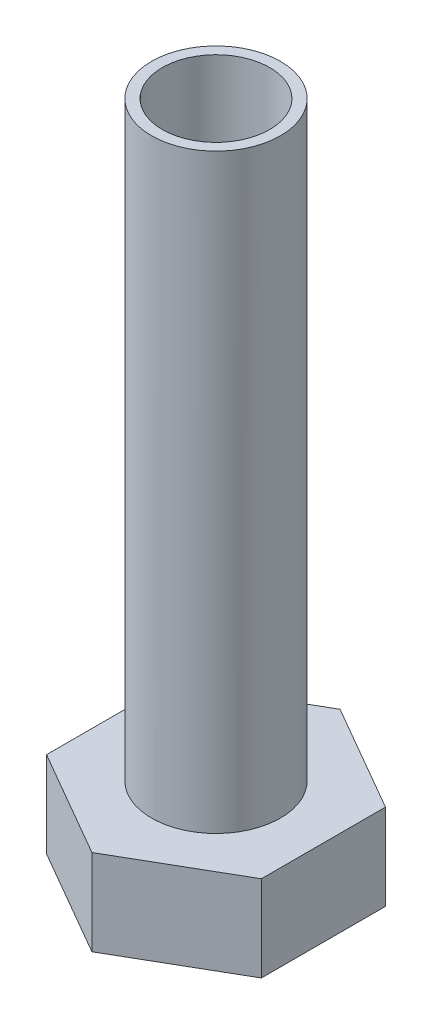
ISO-10303-21;
HEADER;
FILE_DESCRIPTION(('STEP AP214'),'2;1');
FILE_NAME('part.step','',(''),(''),'','','');
FILE_SCHEMA(('AUTOMOTIVE_DESIGN { 1 0 10303 214 1 1 1 1 }'));
ENDSEC;
DATA;
#1=APPLICATION_CONTEXT('core data for automotive mechanical design processes');
#2=APPLICATION_PROTOCOL_DEFINITION('international standard','automotive_design',2000,#1);
#3=PRODUCT_CONTEXT('',#1,'mechanical');
#4=PRODUCT('Part','Part','',(#3));
#5=PRODUCT_RELATED_PRODUCT_CATEGORY('part','',(#4));
#6=PRODUCT_DEFINITION_FORMATION('','',#4);
#7=PRODUCT_DEFINITION_CONTEXT('part definition',#1,'design');
#8=PRODUCT_DEFINITION('design','',#6,#7);
#9=PRODUCT_DEFINITION_SHAPE('','',#8);
#10=(LENGTH_UNIT() NAMED_UNIT(*) SI_UNIT(.MILLI.,.METRE.));
#11=(NAMED_UNIT(*) PLANE_ANGLE_UNIT() SI_UNIT($,.RADIAN.));
#12=(NAMED_UNIT(*) SI_UNIT($,.STERADIAN.) SOLID_ANGLE_UNIT());
#13=UNCERTAINTY_MEASURE_WITH_UNIT(LENGTH_MEASURE(1.E-05),#10,'distance_accuracy_value','');
#14=(GEOMETRIC_REPRESENTATION_CONTEXT(3) GLOBAL_UNCERTAINTY_ASSIGNED_CONTEXT((#13)) GLOBAL_UNIT_ASSIGNED_CONTEXT((#10,
#11,#12)) REPRESENTATION_CONTEXT('',''));
#15=CARTESIAN_POINT('',(0.,0.,0.));
#16=DIRECTION('',(0.,0.,1.));
#17=DIRECTION('',(1.,0.,0.));
#18=AXIS2_PLACEMENT_3D('',#15,#16,#17);
#19=CARTESIAN_POINT('',(0.,27.5,0.));
#20=DIRECTION('',(0.,1.,0.));
#21=DIRECTION('',(0.,0.,1.));
#22=AXIS2_PLACEMENT_3D('',#19,#20,#21);
#23=PLANE('',#22);
#24=CARTESIAN_POINT('',(0.,27.5,0.));
#25=DIRECTION('',(0.,1.,0.));
#26=DIRECTION('',(0.,0.,1.));
#27=AXIS2_PLACEMENT_3D('',#24,#25,#26);
#28=CIRCLE('',#27,3.);
#29=CARTESIAN_POINT('',(0.,27.5,3.));
#30=VERTEX_POINT('',#29);
#31=EDGE_CURVE('E11',#30,#30,#28,.T.);
#32=ORIENTED_EDGE('',*,*,#31,.T.);
#33=EDGE_LOOP('',(#32));
#34=FACE_BOUND('',#33,.T.);
#35=CARTESIAN_POINT('',(0.,27.5,0.));
#36=DIRECTION('',(0.,1.,0.));
#37=DIRECTION('',(0.,0.,1.));
#38=AXIS2_PLACEMENT_3D('',#35,#36,#37);
#39=CIRCLE('',#38,2.5);
#40=CARTESIAN_POINT('',(0.,27.5,2.5));
#41=VERTEX_POINT('',#40);
#42=EDGE_CURVE('E42',#41,#41,#39,.T.);
#43=ORIENTED_EDGE('',*,*,#42,.F.);
#44=EDGE_LOOP('',(#43));
#45=FACE_BOUND('',#44,.T.);
#46=ADVANCED_FACE('F33',(#34,#45),#23,.T.);
#47=CARTESIAN_POINT('',(0.,27.5,0.));
#48=DIRECTION('',(0.,-1.,0.));
#49=DIRECTION('',(0.,0.,-1.));
#50=AXIS2_PLACEMENT_3D('',#47,#48,#49);
#51=CYLINDRICAL_SURFACE('',#50,3.);
#52=ORIENTED_EDGE('',*,*,#31,.F.);
#53=EDGE_LOOP('',(#52));
#54=FACE_BOUND('',#53,.T.);
#55=CARTESIAN_POINT('',(0.,0.,0.));
#56=DIRECTION('',(0.,-1.,0.));
#57=DIRECTION('',(0.,0.,-1.));
#58=AXIS2_PLACEMENT_3D('',#55,#56,#57);
#59=CIRCLE('',#58,3.);
#60=CARTESIAN_POINT('',(0.,0.,-3.));
#61=VERTEX_POINT('',#60);
#62=EDGE_CURVE('E138',#61,#61,#59,.T.);
#63=ORIENTED_EDGE('',*,*,#62,.F.);
#64=EDGE_LOOP('',(#63));
#65=FACE_BOUND('',#64,.T.);
#66=ADVANCED_FACE('F35',(#54,#65),#51,.T.);
#67=CARTESIAN_POINT('',(0.,27.5,0.));
#68=DIRECTION('',(0.,-1.,0.));
#69=DIRECTION('',(0.,0.,-1.));
#70=AXIS2_PLACEMENT_3D('',#67,#68,#69);
#71=CYLINDRICAL_SURFACE('',#70,2.5);
#72=ORIENTED_EDGE('',*,*,#42,.T.);
#73=EDGE_LOOP('',(#72));
#74=FACE_BOUND('',#73,.T.);
#75=CARTESIAN_POINT('',(0.,0.,0.));
#76=DIRECTION('',(0.,1.,0.));
#77=DIRECTION('',(0.,0.,1.));
#78=AXIS2_PLACEMENT_3D('',#75,#76,#77);
#79=CIRCLE('',#78,2.5);
#80=CARTESIAN_POINT('',(0.,0.,2.5));
#81=VERTEX_POINT('',#80);
#82=EDGE_CURVE('E141',#81,#81,#79,.T.);
#83=ORIENTED_EDGE('',*,*,#82,.F.);
#84=EDGE_LOOP('',(#83));
#85=FACE_BOUND('',#84,.T.);
#86=ADVANCED_FACE('F148',(#74,#85),#71,.F.);
#87=CARTESIAN_POINT('',(0.,0.,0.));
#88=DIRECTION('',(0.,-1.,0.));
#89=DIRECTION('',(0.,0.,-1.));
#90=AXIS2_PLACEMENT_3D('',#87,#88,#89);
#91=PLANE('',#90);
#92=ORIENTED_EDGE('',*,*,#82,.T.);
#93=EDGE_LOOP('',(#92));
#94=FACE_BOUND('',#93,.T.);
#95=ADVANCED_FACE('F146',(#94),#91,.F.);
#96=DIRECTION('',(-0.866025403784439,0.,0.5));
#97=VECTOR('',#96,1.);
#98=CARTESIAN_POINT('',(4.99999999999999,0.,2.88675134594813));
#99=LINE('',#98,#97);
#100=CARTESIAN_POINT('',(4.99999999999999,0.,2.88675134594813));
#101=VERTEX_POINT('',#100);
#102=CARTESIAN_POINT('',(0.,0.,5.77350269189626));
#103=VERTEX_POINT('',#102);
#104=EDGE_CURVE('E119',#101,#103,#99,.T.);
#105=ORIENTED_EDGE('',*,*,#104,.F.);
#106=DIRECTION('',(0.,0.,1.));
#107=VECTOR('',#106,1.);
#108=CARTESIAN_POINT('',(5.,0.,-2.88675134594813));
#109=LINE('',#108,#107);
#110=CARTESIAN_POINT('',(5.,0.,-2.88675134594813));
#111=VERTEX_POINT('',#110);
#112=EDGE_CURVE('E79',#111,#101,#109,.T.);
#113=ORIENTED_EDGE('',*,*,#112,.F.);
#114=DIRECTION('',(0.866025403784439,0.,0.5));
#115=VECTOR('',#114,1.);
#116=CARTESIAN_POINT('',(0.,0.,-5.77350269189626));
#117=LINE('',#116,#115);
#118=CARTESIAN_POINT('',(0.,0.,-5.77350269189626));
#119=VERTEX_POINT('',#118);
#120=EDGE_CURVE('E73',#119,#111,#117,.T.);
#121=ORIENTED_EDGE('',*,*,#120,.F.);
#122=DIRECTION('',(0.866025403784439,0.,-0.5));
#123=VECTOR('',#122,1.);
#124=CARTESIAN_POINT('',(-5.,0.,-2.88675134594813));
#125=LINE('',#124,#123);
#126=CARTESIAN_POINT('',(-5.,0.,-2.88675134594813));
#127=VERTEX_POINT('',#126);
#128=EDGE_CURVE('E109',#127,#119,#125,.T.);
#129=ORIENTED_EDGE('',*,*,#128,.F.);
#130=DIRECTION('',(0.,0.,-1.));
#131=VECTOR('',#130,1.);
#132=CARTESIAN_POINT('',(-5.,0.,2.88675134594813));
#133=LINE('',#132,#131);
#134=CARTESIAN_POINT('',(-5.,0.,2.88675134594813));
#135=VERTEX_POINT('',#134);
#136=EDGE_CURVE('E124',#135,#127,#133,.T.);
#137=ORIENTED_EDGE('',*,*,#136,.F.);
#138=DIRECTION('',(-0.866025403784439,0.,-0.5));
#139=VECTOR('',#138,1.);
#140=CARTESIAN_POINT('',(0.,0.,5.77350269189626));
#141=LINE('',#140,#139);
#142=EDGE_CURVE('E122',#103,#135,#141,.T.);
#143=ORIENTED_EDGE('',*,*,#142,.F.);
#144=EDGE_LOOP('',(#105,#113,#121,#129,#137,#143));
#145=FACE_BOUND('',#144,.T.);
#146=ORIENTED_EDGE('',*,*,#62,.T.);
#147=EDGE_LOOP('',(#146));
#148=FACE_BOUND('',#147,.T.);
#149=ADVANCED_FACE('F156',(#145,#148),#91,.F.);
#150=CARTESIAN_POINT('',(4.99999999999999,-4.,2.88675134594813));
#151=DIRECTION('',(-0.5,0.,-0.866025403784439));
#152=DIRECTION('',(-0.866025403784439,0.,0.5));
#153=AXIS2_PLACEMENT_3D('',#150,#151,#152);
#154=PLANE('',#153);
#155=ORIENTED_EDGE('',*,*,#104,.T.);
#156=DIRECTION('',(0.,1.,0.));
#157=VECTOR('',#156,1.);
#158=CARTESIAN_POINT('',(0.,-4.,5.77350269189626));
#159=LINE('',#158,#157);
#160=CARTESIAN_POINT('',(0.,-4.,5.77350269189626));
#161=VERTEX_POINT('',#160);
#162=EDGE_CURVE('E136',#161,#103,#159,.T.);
#163=ORIENTED_EDGE('',*,*,#162,.F.);
#164=DIRECTION('',(-0.866025403784439,0.,0.5));
#165=VECTOR('',#164,1.);
#166=CARTESIAN_POINT('',(4.99999999999999,-4.,2.88675134594813));
#167=LINE('',#166,#165);
#168=CARTESIAN_POINT('',(4.99999999999999,-4.,2.88675134594813));
#169=VERTEX_POINT('',#168);
#170=EDGE_CURVE('E129',#169,#161,#167,.T.);
#171=ORIENTED_EDGE('',*,*,#170,.F.);
#172=DIRECTION('',(0.,1.,0.));
#173=VECTOR('',#172,1.);
#174=CARTESIAN_POINT('',(4.99999999999999,-4.,2.88675134594813));
#175=LINE('',#174,#173);
#176=EDGE_CURVE('E115',#169,#101,#175,.T.);
#177=ORIENTED_EDGE('',*,*,#176,.T.);
#178=EDGE_LOOP('',(#155,#163,#171,#177));
#179=FACE_BOUND('',#178,.T.);
#180=ADVANCED_FACE('F171',(#179),#154,.F.);
#181=CARTESIAN_POINT('',(0.,-4.,5.77350269189626));
#182=DIRECTION('',(0.5,0.,-0.866025403784439));
#183=DIRECTION('',(-0.866025403784439,0.,-0.5));
#184=AXIS2_PLACEMENT_3D('',#181,#182,#183);
#185=PLANE('',#184);
#186=ORIENTED_EDGE('',*,*,#142,.T.);
#187=DIRECTION('',(0.,1.,0.));
#188=VECTOR('',#187,1.);
#189=CARTESIAN_POINT('',(-5.,-4.,2.88675134594813));
#190=LINE('',#189,#188);
#191=CARTESIAN_POINT('',(-5.,-4.,2.88675134594813));
#192=VERTEX_POINT('',#191);
#193=EDGE_CURVE('E133',#192,#135,#190,.T.);
#194=ORIENTED_EDGE('',*,*,#193,.F.);
#195=DIRECTION('',(-0.866025403784439,0.,-0.5));
#196=VECTOR('',#195,1.);
#197=CARTESIAN_POINT('',(0.,-4.,5.77350269189626));
#198=LINE('',#197,#196);
#199=EDGE_CURVE('E88',#161,#192,#198,.T.);
#200=ORIENTED_EDGE('',*,*,#199,.F.);
#201=ORIENTED_EDGE('',*,*,#162,.T.);
#202=EDGE_LOOP('',(#186,#194,#200,#201));
#203=FACE_BOUND('',#202,.T.);
#204=ADVANCED_FACE('F176',(#203),#185,.F.);
#205=CARTESIAN_POINT('',(-5.,-4.,2.88675134594813));
#206=DIRECTION('',(1.,0.,0.));
#207=DIRECTION('',(0.,0.,-1.));
#208=AXIS2_PLACEMENT_3D('',#205,#206,#207);
#209=PLANE('',#208);
#210=ORIENTED_EDGE('',*,*,#136,.T.);
#211=DIRECTION('',(0.,1.,0.));
#212=VECTOR('',#211,1.);
#213=CARTESIAN_POINT('',(-5.,-4.,-2.88675134594813));
#214=LINE('',#213,#212);
#215=CARTESIAN_POINT('',(-5.,-4.,-2.88675134594813));
#216=VERTEX_POINT('',#215);
#217=EDGE_CURVE('E110',#216,#127,#214,.T.);
#218=ORIENTED_EDGE('',*,*,#217,.F.);
#219=DIRECTION('',(0.,0.,-1.));
#220=VECTOR('',#219,1.);
#221=CARTESIAN_POINT('',(-5.,-4.,2.88675134594813));
#222=LINE('',#221,#220);
#223=EDGE_CURVE('E101',#192,#216,#222,.T.);
#224=ORIENTED_EDGE('',*,*,#223,.F.);
#225=ORIENTED_EDGE('',*,*,#193,.T.);
#226=EDGE_LOOP('',(#210,#218,#224,#225));
#227=FACE_BOUND('',#226,.T.);
#228=ADVANCED_FACE('F188',(#227),#209,.F.);
#229=CARTESIAN_POINT('',(-5.,-4.,-2.88675134594813));
#230=DIRECTION('',(0.5,0.,0.866025403784439));
#231=DIRECTION('',(0.866025403784439,0.,-0.5));
#232=AXIS2_PLACEMENT_3D('',#229,#230,#231);
#233=PLANE('',#232);
#234=ORIENTED_EDGE('',*,*,#128,.T.);
#235=DIRECTION('',(0.,1.,0.));
#236=VECTOR('',#235,1.);
#237=CARTESIAN_POINT('',(0.,-4.,-5.77350269189626));
#238=LINE('',#237,#236);
#239=CARTESIAN_POINT('',(0.,-4.,-5.77350269189626));
#240=VERTEX_POINT('',#239);
#241=EDGE_CURVE('E106',#240,#119,#238,.T.);
#242=ORIENTED_EDGE('',*,*,#241,.F.);
#243=DIRECTION('',(0.866025403784439,0.,-0.5));
#244=VECTOR('',#243,1.);
#245=CARTESIAN_POINT('',(-5.,-4.,-2.88675134594813));
#246=LINE('',#245,#244);
#247=EDGE_CURVE('E95',#216,#240,#246,.T.);
#248=ORIENTED_EDGE('',*,*,#247,.F.);
#249=ORIENTED_EDGE('',*,*,#217,.T.);
#250=EDGE_LOOP('',(#234,#242,#248,#249));
#251=FACE_BOUND('',#250,.T.);
#252=ADVANCED_FACE('F107',(#251),#233,.F.);
#253=CARTESIAN_POINT('',(0.,-4.,-5.77350269189626));
#254=DIRECTION('',(-0.5,0.,0.866025403784439));
#255=DIRECTION('',(0.866025403784439,0.,0.5));
#256=AXIS2_PLACEMENT_3D('',#253,#254,#255);
#257=PLANE('',#256);
#258=ORIENTED_EDGE('',*,*,#120,.T.);
#259=DIRECTION('',(0.,1.,0.));
#260=VECTOR('',#259,1.);
#261=CARTESIAN_POINT('',(5.,-4.,-2.88675134594813));
#262=LINE('',#261,#260);
#263=CARTESIAN_POINT('',(5.,-4.,-2.88675134594813));
#264=VERTEX_POINT('',#263);
#265=EDGE_CURVE('E111',#264,#111,#262,.T.);
#266=ORIENTED_EDGE('',*,*,#265,.F.);
#267=DIRECTION('',(0.866025403784439,0.,0.5));
#268=VECTOR('',#267,1.);
#269=CARTESIAN_POINT('',(0.,-4.,-5.77350269189626));
#270=LINE('',#269,#268);
#271=EDGE_CURVE('E99',#240,#264,#270,.T.);
#272=ORIENTED_EDGE('',*,*,#271,.F.);
#273=ORIENTED_EDGE('',*,*,#241,.T.);
#274=EDGE_LOOP('',(#258,#266,#272,#273));
#275=FACE_BOUND('',#274,.T.);
#276=ADVANCED_FACE('F113',(#275),#257,.F.);
#277=CARTESIAN_POINT('',(5.,-4.,-2.88675134594813));
#278=DIRECTION('',(-1.,0.,0.));
#279=DIRECTION('',(0.,0.,1.));
#280=AXIS2_PLACEMENT_3D('',#277,#278,#279);
#281=PLANE('',#280);
#282=ORIENTED_EDGE('',*,*,#112,.T.);
#283=ORIENTED_EDGE('',*,*,#176,.F.);
#284=DIRECTION('',(0.,0.,1.));
#285=VECTOR('',#284,1.);
#286=CARTESIAN_POINT('',(5.,-4.,-2.88675134594813));
#287=LINE('',#286,#285);
#288=EDGE_CURVE('E50',#264,#169,#287,.T.);
#289=ORIENTED_EDGE('',*,*,#288,.F.);
#290=ORIENTED_EDGE('',*,*,#265,.T.);
#291=EDGE_LOOP('',(#282,#283,#289,#290));
#292=FACE_BOUND('',#291,.T.);
#293=ADVANCED_FACE('F181',(#292),#281,.F.);
#294=CARTESIAN_POINT('',(0.,-4.,0.));
#295=DIRECTION('',(0.,-1.,0.));
#296=DIRECTION('',(0.,0.,-1.));
#297=AXIS2_PLACEMENT_3D('',#294,#295,#296);
#298=PLANE('',#297);
#299=ORIENTED_EDGE('',*,*,#170,.T.);
#300=ORIENTED_EDGE('',*,*,#199,.T.);
#301=ORIENTED_EDGE('',*,*,#223,.T.);
#302=ORIENTED_EDGE('',*,*,#247,.T.);
#303=ORIENTED_EDGE('',*,*,#271,.T.);
#304=ORIENTED_EDGE('',*,*,#288,.T.);
#305=EDGE_LOOP('',(#299,#300,#301,#302,#303,#304));
#306=FACE_BOUND('',#305,.T.);
#307=ADVANCED_FACE('F97',(#306),#298,.T.);
#308=CLOSED_SHELL('',(#46,#66,#86,#95,#149,#180,#204,#228,#252,#276,#293,#307));
#309=MANIFOLD_SOLID_BREP('B2',#308);
#310=ADVANCED_BREP_SHAPE_REPRESENTATION('',(#18,#309),#14);
#311=SHAPE_DEFINITION_REPRESENTATION(#9,#310);
ENDSEC;
END-ISO-10303-21;
